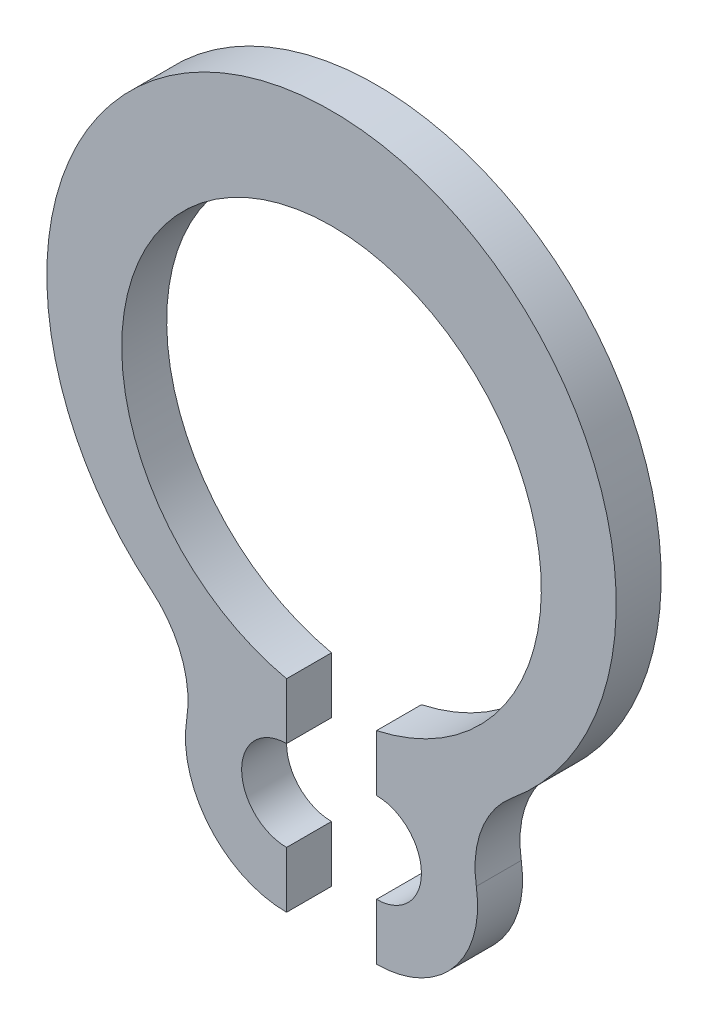
ISO-10303-21;
HEADER;
FILE_DESCRIPTION(('STEP AP214'),'2;1');
FILE_NAME('part.step','',(''),(''),'','','');
FILE_SCHEMA(('AUTOMOTIVE_DESIGN { 1 0 10303 214 1 1 1 1 }'));
ENDSEC;
DATA;
#1=APPLICATION_CONTEXT('core data for automotive mechanical design processes');
#2=APPLICATION_PROTOCOL_DEFINITION('international standard','automotive_design',2000,#1);
#3=PRODUCT_CONTEXT('',#1,'mechanical');
#4=PRODUCT('Part','Part','',(#3));
#5=PRODUCT_RELATED_PRODUCT_CATEGORY('part','',(#4));
#6=PRODUCT_DEFINITION_FORMATION('','',#4);
#7=PRODUCT_DEFINITION_CONTEXT('part definition',#1,'design');
#8=PRODUCT_DEFINITION('design','',#6,#7);
#9=PRODUCT_DEFINITION_SHAPE('','',#8);
#10=(LENGTH_UNIT() NAMED_UNIT(*) SI_UNIT(.MILLI.,.METRE.));
#11=(NAMED_UNIT(*) PLANE_ANGLE_UNIT() SI_UNIT($,.RADIAN.));
#12=(NAMED_UNIT(*) SI_UNIT($,.STERADIAN.) SOLID_ANGLE_UNIT());
#13=UNCERTAINTY_MEASURE_WITH_UNIT(LENGTH_MEASURE(1.E-05),#10,'distance_accuracy_value','');
#14=(GEOMETRIC_REPRESENTATION_CONTEXT(3) GLOBAL_UNCERTAINTY_ASSIGNED_CONTEXT((#13)) GLOBAL_UNIT_ASSIGNED_CONTEXT((#10,
#11,#12)) REPRESENTATION_CONTEXT('',''));
#15=CARTESIAN_POINT('',(0.,0.,0.));
#16=DIRECTION('',(0.,0.,1.));
#17=DIRECTION('',(1.,0.,0.));
#18=AXIS2_PLACEMENT_3D('',#15,#16,#17);
#19=CARTESIAN_POINT('',(-0.6,-4.41495886623547,-0.6));
#20=DIRECTION('',(0.,0.,1.));
#21=DIRECTION('',(1.,0.,0.));
#22=AXIS2_PLACEMENT_3D('',#19,#20,#21);
#23=PLANE('',#22);
#24=DIRECTION('',(0.,1.,0.));
#25=VECTOR('',#24,1.);
#26=CARTESIAN_POINT('',(-0.6,-4.41495886623547,-0.6));
#27=LINE('',#26,#25);
#28=CARTESIAN_POINT('',(-0.599999999999999,-5.76495886623547,-0.6));
#29=VERTEX_POINT('',#28);
#30=CARTESIAN_POINT('',(-0.6,-5.01495886623547,-0.6));
#31=VERTEX_POINT('',#30);
#32=EDGE_CURVE('E113',#29,#31,#27,.T.);
#33=ORIENTED_EDGE('',*,*,#32,.F.);
#34=CARTESIAN_POINT('',(-0.6,-4.41495886623547,-0.6));
#35=DIRECTION('',(0.,0.,1.));
#36=DIRECTION('',(1.,0.,0.));
#37=AXIS2_PLACEMENT_3D('',#34,#35,#36);
#38=CIRCLE('',#37,1.35);
#39=CARTESIAN_POINT('',(-1.93258015045455,-4.19878730794317,-0.6));
#40=VERTEX_POINT('',#39);
#41=EDGE_CURVE('E175',#40,#29,#38,.T.);
#42=ORIENTED_EDGE('',*,*,#41,.F.);
#43=CARTESIAN_POINT('',(-3.26516030090911,-3.98261574965087,-0.6));
#44=DIRECTION('',(0.,0.,1.));
#45=DIRECTION('',(1.,0.,0.));
#46=AXIS2_PLACEMENT_3D('',#43,#44,#45);
#47=CIRCLE('',#46,1.35);
#48=CARTESIAN_POINT('',(-2.40924449387468,-2.93862909682977,-0.6));
#49=VERTEX_POINT('',#48);
#50=EDGE_CURVE('E179',#40,#49,#47,.T.);
#51=ORIENTED_EDGE('',*,*,#50,.T.);
#52=CARTESIAN_POINT('',(0.,0.,-0.6));
#53=DIRECTION('',(0.,0.,1.));
#54=DIRECTION('',(1.,0.,0.));
#55=AXIS2_PLACEMENT_3D('',#52,#53,#54);
#56=CIRCLE('',#55,3.8);
#57=CARTESIAN_POINT('',(2.40924449387468,-2.93862909682977,-0.6));
#58=VERTEX_POINT('',#57);
#59=EDGE_CURVE('E183',#58,#49,#56,.T.);
#60=ORIENTED_EDGE('',*,*,#59,.F.);
#61=CARTESIAN_POINT('',(3.26516030090911,-3.98261574965087,-0.6));
#62=DIRECTION('',(0.,0.,1.));
#63=DIRECTION('',(1.,0.,0.));
#64=AXIS2_PLACEMENT_3D('',#61,#62,#63);
#65=CIRCLE('',#64,1.35);
#66=CARTESIAN_POINT('',(1.93258015045455,-4.19878730794317,-0.6));
#67=VERTEX_POINT('',#66);
#68=EDGE_CURVE('E188',#58,#67,#65,.T.);
#69=ORIENTED_EDGE('',*,*,#68,.T.);
#70=CARTESIAN_POINT('',(0.600000000000001,-4.41495886623547,-0.6));
#71=DIRECTION('',(0.,0.,1.));
#72=DIRECTION('',(1.,0.,0.));
#73=AXIS2_PLACEMENT_3D('',#70,#71,#72);
#74=CIRCLE('',#73,1.35);
#75=CARTESIAN_POINT('',(0.600000000000001,-5.76495886623547,-0.6));
#76=VERTEX_POINT('',#75);
#77=EDGE_CURVE('E192',#76,#67,#74,.T.);
#78=ORIENTED_EDGE('',*,*,#77,.F.);
#79=DIRECTION('',(0.,-1.,0.));
#80=VECTOR('',#79,1.);
#81=CARTESIAN_POINT('',(0.600000000000001,-5.01495886623547,-0.6));
#82=LINE('',#81,#80);
#83=CARTESIAN_POINT('',(0.600000000000001,-5.01495886623547,-0.6));
#84=VERTEX_POINT('',#83);
#85=EDGE_CURVE('E136',#84,#76,#82,.T.);
#86=ORIENTED_EDGE('',*,*,#85,.F.);
#87=CARTESIAN_POINT('',(0.600000000000001,-4.41495886623547,-0.6));
#88=DIRECTION('',(0.,0.,1.));
#89=DIRECTION('',(1.,0.,0.));
#90=AXIS2_PLACEMENT_3D('',#87,#88,#89);
#91=CIRCLE('',#90,0.6);
#92=CARTESIAN_POINT('',(0.600000000000001,-3.81495886623547,-0.6));
#93=VERTEX_POINT('',#92);
#94=EDGE_CURVE('E196',#84,#93,#91,.T.);
#95=ORIENTED_EDGE('',*,*,#94,.T.);
#96=DIRECTION('',(0.,-1.,0.));
#97=VECTOR('',#96,1.);
#98=CARTESIAN_POINT('',(0.6,-3.06495886623547,-0.6));
#99=LINE('',#98,#97);
#100=CARTESIAN_POINT('',(0.6,-3.06495886623547,-0.6));
#101=VERTEX_POINT('',#100);
#102=EDGE_CURVE('E142',#101,#93,#99,.T.);
#103=ORIENTED_EDGE('',*,*,#102,.F.);
#104=CARTESIAN_POINT('',(0.,-0.33,-0.6));
#105=DIRECTION('',(0.,0.,1.));
#106=DIRECTION('',(1.,0.,0.));
#107=AXIS2_PLACEMENT_3D('',#104,#105,#106);
#108=CIRCLE('',#107,2.8);
#109=CARTESIAN_POINT('',(-0.6,-3.06495886623547,-0.6));
#110=VERTEX_POINT('',#109);
#111=EDGE_CURVE('E117',#101,#110,#108,.T.);
#112=ORIENTED_EDGE('',*,*,#111,.T.);
#113=DIRECTION('',(0.,1.,0.));
#114=VECTOR('',#113,1.);
#115=CARTESIAN_POINT('',(-0.6,-3.06495886623547,-0.6));
#116=LINE('',#115,#114);
#117=CARTESIAN_POINT('',(-0.6,-3.81495886623547,-0.6));
#118=VERTEX_POINT('',#117);
#119=EDGE_CURVE('E115',#118,#110,#116,.T.);
#120=ORIENTED_EDGE('',*,*,#119,.F.);
#121=CARTESIAN_POINT('',(-0.6,-4.41495886623547,-0.6));
#122=DIRECTION('',(0.,0.,1.));
#123=DIRECTION('',(1.,0.,0.));
#124=AXIS2_PLACEMENT_3D('',#121,#122,#123);
#125=CIRCLE('',#124,0.6);
#126=EDGE_CURVE('E19',#118,#31,#125,.T.);
#127=ORIENTED_EDGE('',*,*,#126,.T.);
#128=EDGE_LOOP('',(#33,#42,#51,#60,#69,#78,#86,#95,#103,#112,#120,#127));
#129=FACE_BOUND('',#128,.T.);
#130=ADVANCED_FACE('F16',(#129),#23,.F.);
#131=CARTESIAN_POINT('',(-0.6,-4.41495886623547,-0.6));
#132=DIRECTION('',(0.,0.,1.));
#133=DIRECTION('',(1.,0.,0.));
#134=AXIS2_PLACEMENT_3D('',#131,#132,#133);
#135=CYLINDRICAL_SURFACE('',#134,0.6);
#136=DIRECTION('',(0.,0.,1.));
#137=VECTOR('',#136,1.);
#138=CARTESIAN_POINT('',(-0.6,-5.01495886623547,-0.6));
#139=LINE('',#138,#137);
#140=CARTESIAN_POINT('',(-0.6,-5.01495886623547,0.));
#141=VERTEX_POINT('',#140);
#142=EDGE_CURVE('E110',#31,#141,#139,.T.);
#143=ORIENTED_EDGE('',*,*,#142,.F.);
#144=ORIENTED_EDGE('',*,*,#126,.F.);
#145=DIRECTION('',(0.,0.,1.));
#146=VECTOR('',#145,1.);
#147=CARTESIAN_POINT('',(-0.6,-3.81495886623547,-0.6));
#148=LINE('',#147,#146);
#149=CARTESIAN_POINT('',(-0.6,-3.81495886623547,0.));
#150=VERTEX_POINT('',#149);
#151=EDGE_CURVE('E107',#150,#118,#148,.F.);
#152=ORIENTED_EDGE('',*,*,#151,.F.);
#153=CARTESIAN_POINT('',(-0.6,-4.41495886623547,0.));
#154=DIRECTION('',(0.,0.,1.));
#155=DIRECTION('',(1.,0.,0.));
#156=AXIS2_PLACEMENT_3D('',#153,#154,#155);
#157=CIRCLE('',#156,0.6);
#158=EDGE_CURVE('E172',#141,#150,#157,.F.);
#159=ORIENTED_EDGE('',*,*,#158,.F.);
#160=EDGE_LOOP('',(#143,#144,#152,#159));
#161=FACE_BOUND('',#160,.T.);
#162=ADVANCED_FACE('F105',(#161),#135,.F.);
#163=CARTESIAN_POINT('',(-0.6,-3.06495886623547,-0.6));
#164=DIRECTION('',(1.,0.,0.));
#165=DIRECTION('',(0.,1.,0.));
#166=AXIS2_PLACEMENT_3D('',#163,#164,#165);
#167=PLANE('',#166);
#168=ORIENTED_EDGE('',*,*,#119,.T.);
#169=DIRECTION('',(0.,0.,1.));
#170=VECTOR('',#169,1.);
#171=CARTESIAN_POINT('',(-0.600000000000001,-3.06495886623547,-0.6));
#172=LINE('',#171,#170);
#173=CARTESIAN_POINT('',(-0.6,-3.06495886623547,0.));
#174=VERTEX_POINT('',#173);
#175=EDGE_CURVE('E121',#110,#174,#172,.T.);
#176=ORIENTED_EDGE('',*,*,#175,.T.);
#177=DIRECTION('',(0.,1.,0.));
#178=VECTOR('',#177,1.);
#179=CARTESIAN_POINT('',(-0.6,-4.41495886623547,0.));
#180=LINE('',#179,#178);
#181=EDGE_CURVE('E125',#150,#174,#180,.T.);
#182=ORIENTED_EDGE('',*,*,#181,.F.);
#183=ORIENTED_EDGE('',*,*,#151,.T.);
#184=EDGE_LOOP('',(#168,#176,#182,#183));
#185=FACE_BOUND('',#184,.T.);
#186=ADVANCED_FACE('F123',(#185),#167,.T.);
#187=CARTESIAN_POINT('',(0.,-0.33,-0.6));
#188=DIRECTION('',(0.,0.,1.));
#189=DIRECTION('',(1.,0.,0.));
#190=AXIS2_PLACEMENT_3D('',#187,#188,#189);
#191=CYLINDRICAL_SURFACE('',#190,2.8);
#192=ORIENTED_EDGE('',*,*,#111,.F.);
#193=DIRECTION('',(0.,0.,1.));
#194=VECTOR('',#193,1.);
#195=CARTESIAN_POINT('',(0.6,-3.06495886623547,-0.6));
#196=LINE('',#195,#194);
#197=CARTESIAN_POINT('',(0.6,-3.06495886623547,0.));
#198=VERTEX_POINT('',#197);
#199=EDGE_CURVE('E146',#198,#101,#196,.F.);
#200=ORIENTED_EDGE('',*,*,#199,.F.);
#201=CARTESIAN_POINT('',(0.,-0.33,0.));
#202=DIRECTION('',(0.,0.,1.));
#203=DIRECTION('',(1.,0.,0.));
#204=AXIS2_PLACEMENT_3D('',#201,#202,#203);
#205=CIRCLE('',#204,2.8);
#206=EDGE_CURVE('E169',#174,#198,#205,.F.);
#207=ORIENTED_EDGE('',*,*,#206,.F.);
#208=ORIENTED_EDGE('',*,*,#175,.F.);
#209=EDGE_LOOP('',(#192,#200,#207,#208));
#210=FACE_BOUND('',#209,.T.);
#211=ADVANCED_FACE('F205',(#210),#191,.F.);
#212=CARTESIAN_POINT('',(0.6,-3.06495886623547,-0.6));
#213=DIRECTION('',(-1.,0.,0.));
#214=DIRECTION('',(0.,-1.,0.));
#215=AXIS2_PLACEMENT_3D('',#212,#213,#214);
#216=PLANE('',#215);
#217=ORIENTED_EDGE('',*,*,#102,.T.);
#218=DIRECTION('',(0.,0.,1.));
#219=VECTOR('',#218,1.);
#220=CARTESIAN_POINT('',(0.600000000000001,-3.81495886623547,-0.6));
#221=LINE('',#220,#219);
#222=CARTESIAN_POINT('',(0.6,-3.81495886623547,0.));
#223=VERTEX_POINT('',#222);
#224=EDGE_CURVE('E145',#93,#223,#221,.T.);
#225=ORIENTED_EDGE('',*,*,#224,.T.);
#226=DIRECTION('',(0.,1.,0.));
#227=VECTOR('',#226,1.);
#228=CARTESIAN_POINT('',(0.6,-4.41495886623547,0.));
#229=LINE('',#228,#227);
#230=EDGE_CURVE('E168',#198,#223,#229,.F.);
#231=ORIENTED_EDGE('',*,*,#230,.F.);
#232=ORIENTED_EDGE('',*,*,#199,.T.);
#233=EDGE_LOOP('',(#217,#225,#231,#232));
#234=FACE_BOUND('',#233,.T.);
#235=ADVANCED_FACE('F241',(#234),#216,.T.);
#236=CARTESIAN_POINT('',(0.600000000000001,-4.41495886623547,-0.6));
#237=DIRECTION('',(0.,0.,1.));
#238=DIRECTION('',(1.,0.,0.));
#239=AXIS2_PLACEMENT_3D('',#236,#237,#238);
#240=CYLINDRICAL_SURFACE('',#239,0.6);
#241=ORIENTED_EDGE('',*,*,#94,.F.);
#242=DIRECTION('',(0.,0.,1.));
#243=VECTOR('',#242,1.);
#244=CARTESIAN_POINT('',(0.600000000000001,-5.01495886623547,-0.6));
#245=LINE('',#244,#243);
#246=CARTESIAN_POINT('',(0.600000000000001,-5.01495886623547,0.));
#247=VERTEX_POINT('',#246);
#248=EDGE_CURVE('E141',#247,#84,#245,.F.);
#249=ORIENTED_EDGE('',*,*,#248,.F.);
#250=CARTESIAN_POINT('',(0.600000000000001,-4.41495886623547,0.));
#251=DIRECTION('',(0.,0.,1.));
#252=DIRECTION('',(1.,0.,0.));
#253=AXIS2_PLACEMENT_3D('',#250,#251,#252);
#254=CIRCLE('',#253,0.6);
#255=EDGE_CURVE('E165',#223,#247,#254,.F.);
#256=ORIENTED_EDGE('',*,*,#255,.F.);
#257=ORIENTED_EDGE('',*,*,#224,.F.);
#258=EDGE_LOOP('',(#241,#249,#256,#257));
#259=FACE_BOUND('',#258,.T.);
#260=ADVANCED_FACE('F244',(#259),#240,.F.);
#261=CARTESIAN_POINT('',(0.600000000000001,-5.01495886623547,-0.6));
#262=DIRECTION('',(-1.,0.,0.));
#263=DIRECTION('',(0.,-1.,0.));
#264=AXIS2_PLACEMENT_3D('',#261,#262,#263);
#265=PLANE('',#264);
#266=ORIENTED_EDGE('',*,*,#85,.T.);
#267=DIRECTION('',(0.,0.,1.));
#268=VECTOR('',#267,1.);
#269=CARTESIAN_POINT('',(0.600000000000001,-5.76495886623547,-0.6));
#270=LINE('',#269,#268);
#271=CARTESIAN_POINT('',(0.600000000000001,-5.76495886623547,0.));
#272=VERTEX_POINT('',#271);
#273=EDGE_CURVE('E140',#272,#76,#270,.F.);
#274=ORIENTED_EDGE('',*,*,#273,.F.);
#275=DIRECTION('',(0.,1.,0.));
#276=VECTOR('',#275,1.);
#277=CARTESIAN_POINT('',(0.600000000000001,-4.41495886623547,0.));
#278=LINE('',#277,#276);
#279=EDGE_CURVE('E164',#247,#272,#278,.F.);
#280=ORIENTED_EDGE('',*,*,#279,.F.);
#281=ORIENTED_EDGE('',*,*,#248,.T.);
#282=EDGE_LOOP('',(#266,#274,#280,#281));
#283=FACE_BOUND('',#282,.T.);
#284=ADVANCED_FACE('F253',(#283),#265,.T.);
#285=CARTESIAN_POINT('',(0.600000000000001,-4.41495886623547,-0.6));
#286=DIRECTION('',(0.,0.,1.));
#287=DIRECTION('',(1.,0.,0.));
#288=AXIS2_PLACEMENT_3D('',#285,#286,#287);
#289=CYLINDRICAL_SURFACE('',#288,1.35);
#290=DIRECTION('',(0.,0.,1.));
#291=VECTOR('',#290,1.);
#292=CARTESIAN_POINT('',(1.93258015045455,-4.19878730794317,-0.6));
#293=LINE('',#292,#291);
#294=CARTESIAN_POINT('',(1.93258015045455,-4.19878730794317,0.));
#295=VERTEX_POINT('',#294);
#296=EDGE_CURVE('E191',#67,#295,#293,.T.);
#297=ORIENTED_EDGE('',*,*,#296,.T.);
#298=CARTESIAN_POINT('',(0.600000000000001,-4.41495886623547,0.));
#299=DIRECTION('',(0.,0.,1.));
#300=DIRECTION('',(1.,0.,0.));
#301=AXIS2_PLACEMENT_3D('',#298,#299,#300);
#302=CIRCLE('',#301,1.35);
#303=EDGE_CURVE('E161',#272,#295,#302,.T.);
#304=ORIENTED_EDGE('',*,*,#303,.F.);
#305=ORIENTED_EDGE('',*,*,#273,.T.);
#306=ORIENTED_EDGE('',*,*,#77,.T.);
#307=EDGE_LOOP('',(#297,#304,#305,#306));
#308=FACE_BOUND('',#307,.T.);
#309=ADVANCED_FACE('F256',(#308),#289,.T.);
#310=CARTESIAN_POINT('',(3.26516030090911,-3.98261574965087,-0.6));
#311=DIRECTION('',(0.,0.,1.));
#312=DIRECTION('',(1.,0.,0.));
#313=AXIS2_PLACEMENT_3D('',#310,#311,#312);
#314=CYLINDRICAL_SURFACE('',#313,1.35);
#315=ORIENTED_EDGE('',*,*,#296,.F.);
#316=ORIENTED_EDGE('',*,*,#68,.F.);
#317=DIRECTION('',(0.,0.,1.));
#318=VECTOR('',#317,1.);
#319=CARTESIAN_POINT('',(2.40924449387468,-2.93862909682977,-0.6));
#320=LINE('',#319,#318);
#321=CARTESIAN_POINT('',(2.40924449387468,-2.93862909682977,0.));
#322=VERTEX_POINT('',#321);
#323=EDGE_CURVE('E187',#322,#58,#320,.F.);
#324=ORIENTED_EDGE('',*,*,#323,.F.);
#325=CARTESIAN_POINT('',(3.26516030090911,-3.98261574965087,0.));
#326=DIRECTION('',(0.,0.,1.));
#327=DIRECTION('',(1.,0.,0.));
#328=AXIS2_PLACEMENT_3D('',#325,#326,#327);
#329=CIRCLE('',#328,1.35);
#330=EDGE_CURVE('E157',#295,#322,#329,.F.);
#331=ORIENTED_EDGE('',*,*,#330,.F.);
#332=EDGE_LOOP('',(#315,#316,#324,#331));
#333=FACE_BOUND('',#332,.T.);
#334=ADVANCED_FACE('F261',(#333),#314,.F.);
#335=CARTESIAN_POINT('',(0.,0.,-0.6));
#336=DIRECTION('',(0.,0.,1.));
#337=DIRECTION('',(1.,0.,0.));
#338=AXIS2_PLACEMENT_3D('',#335,#336,#337);
#339=CYLINDRICAL_SURFACE('',#338,3.8);
#340=DIRECTION('',(0.,0.,1.));
#341=VECTOR('',#340,1.);
#342=CARTESIAN_POINT('',(-2.40924449387468,-2.93862909682977,-0.6));
#343=LINE('',#342,#341);
#344=CARTESIAN_POINT('',(-2.40924449387468,-2.93862909682977,0.));
#345=VERTEX_POINT('',#344);
#346=EDGE_CURVE('E182',#49,#345,#343,.T.);
#347=ORIENTED_EDGE('',*,*,#346,.T.);
#348=CARTESIAN_POINT('',(0.,0.,0.));
#349=DIRECTION('',(0.,0.,1.));
#350=DIRECTION('',(1.,0.,0.));
#351=AXIS2_PLACEMENT_3D('',#348,#349,#350);
#352=CIRCLE('',#351,3.8);
#353=EDGE_CURVE('E154',#322,#345,#352,.T.);
#354=ORIENTED_EDGE('',*,*,#353,.F.);
#355=ORIENTED_EDGE('',*,*,#323,.T.);
#356=ORIENTED_EDGE('',*,*,#59,.T.);
#357=EDGE_LOOP('',(#347,#354,#355,#356));
#358=FACE_BOUND('',#357,.T.);
#359=ADVANCED_FACE('F267',(#358),#339,.T.);
#360=CARTESIAN_POINT('',(-3.26516030090911,-3.98261574965087,-0.6));
#361=DIRECTION('',(0.,0.,1.));
#362=DIRECTION('',(1.,0.,0.));
#363=AXIS2_PLACEMENT_3D('',#360,#361,#362);
#364=CYLINDRICAL_SURFACE('',#363,1.35);
#365=ORIENTED_EDGE('',*,*,#50,.F.);
#366=DIRECTION('',(0.,0.,1.));
#367=VECTOR('',#366,1.);
#368=CARTESIAN_POINT('',(-1.93258015045455,-4.19878730794317,-0.6));
#369=LINE('',#368,#367);
#370=CARTESIAN_POINT('',(-1.93258015045455,-4.19878730794317,0.));
#371=VERTEX_POINT('',#370);
#372=EDGE_CURVE('E178',#371,#40,#369,.F.);
#373=ORIENTED_EDGE('',*,*,#372,.F.);
#374=CARTESIAN_POINT('',(-3.26516030090911,-3.98261574965087,0.));
#375=DIRECTION('',(0.,0.,1.));
#376=DIRECTION('',(1.,0.,0.));
#377=AXIS2_PLACEMENT_3D('',#374,#375,#376);
#378=CIRCLE('',#377,1.35);
#379=EDGE_CURVE('E151',#345,#371,#378,.F.);
#380=ORIENTED_EDGE('',*,*,#379,.F.);
#381=ORIENTED_EDGE('',*,*,#346,.F.);
#382=EDGE_LOOP('',(#365,#373,#380,#381));
#383=FACE_BOUND('',#382,.T.);
#384=ADVANCED_FACE('F269',(#383),#364,.F.);
#385=CARTESIAN_POINT('',(-0.6,-4.41495886623547,-0.6));
#386=DIRECTION('',(0.,0.,1.));
#387=DIRECTION('',(1.,0.,0.));
#388=AXIS2_PLACEMENT_3D('',#385,#386,#387);
#389=CYLINDRICAL_SURFACE('',#388,1.35);
#390=ORIENTED_EDGE('',*,*,#41,.T.);
#391=DIRECTION('',(0.,0.,1.));
#392=VECTOR('',#391,1.);
#393=CARTESIAN_POINT('',(-0.599999999999999,-5.76495886623547,-0.6));
#394=LINE('',#393,#392);
#395=CARTESIAN_POINT('',(-0.599999999999999,-5.76495886623547,0.));
#396=VERTEX_POINT('',#395);
#397=EDGE_CURVE('E35',#396,#29,#394,.F.);
#398=ORIENTED_EDGE('',*,*,#397,.F.);
#399=CARTESIAN_POINT('',(-0.6,-4.41495886623547,0.));
#400=DIRECTION('',(0.,0.,1.));
#401=DIRECTION('',(1.,0.,0.));
#402=AXIS2_PLACEMENT_3D('',#399,#400,#401);
#403=CIRCLE('',#402,1.35);
#404=EDGE_CURVE('E26',#371,#396,#403,.T.);
#405=ORIENTED_EDGE('',*,*,#404,.F.);
#406=ORIENTED_EDGE('',*,*,#372,.T.);
#407=EDGE_LOOP('',(#390,#398,#405,#406));
#408=FACE_BOUND('',#407,.T.);
#409=ADVANCED_FACE('F271',(#408),#389,.T.);
#410=CARTESIAN_POINT('',(-0.6,-5.01495886623547,-0.6));
#411=DIRECTION('',(1.,0.,0.));
#412=DIRECTION('',(0.,1.,0.));
#413=AXIS2_PLACEMENT_3D('',#410,#411,#412);
#414=PLANE('',#413);
#415=ORIENTED_EDGE('',*,*,#32,.T.);
#416=ORIENTED_EDGE('',*,*,#142,.T.);
#417=DIRECTION('',(0.,1.,0.));
#418=VECTOR('',#417,1.);
#419=CARTESIAN_POINT('',(-0.6,-4.41495886623547,0.));
#420=LINE('',#419,#418);
#421=EDGE_CURVE('E11',#396,#141,#420,.T.);
#422=ORIENTED_EDGE('',*,*,#421,.F.);
#423=ORIENTED_EDGE('',*,*,#397,.T.);
#424=EDGE_LOOP('',(#415,#416,#422,#423));
#425=FACE_BOUND('',#424,.T.);
#426=ADVANCED_FACE('F273',(#425),#414,.T.);
#427=CARTESIAN_POINT('',(-0.6,-4.41495886623547,0.));
#428=DIRECTION('',(0.,0.,1.));
#429=DIRECTION('',(1.,0.,0.));
#430=AXIS2_PLACEMENT_3D('',#427,#428,#429);
#431=PLANE('',#430);
#432=ORIENTED_EDGE('',*,*,#404,.T.);
#433=ORIENTED_EDGE('',*,*,#421,.T.);
#434=ORIENTED_EDGE('',*,*,#158,.T.);
#435=ORIENTED_EDGE('',*,*,#181,.T.);
#436=ORIENTED_EDGE('',*,*,#206,.T.);
#437=ORIENTED_EDGE('',*,*,#230,.T.);
#438=ORIENTED_EDGE('',*,*,#255,.T.);
#439=ORIENTED_EDGE('',*,*,#279,.T.);
#440=ORIENTED_EDGE('',*,*,#303,.T.);
#441=ORIENTED_EDGE('',*,*,#330,.T.);
#442=ORIENTED_EDGE('',*,*,#353,.T.);
#443=ORIENTED_EDGE('',*,*,#379,.T.);
#444=EDGE_LOOP('',(#432,#433,#434,#435,#436,#437,#438,#439,#440,#441,#442,#443));
#445=FACE_BOUND('',#444,.T.);
#446=ADVANCED_FACE('F209',(#445),#431,.T.);
#447=CLOSED_SHELL('',(#130,#162,#186,#211,#235,#260,#284,#309,#334,#359,#384,#409,#426,#446));
#448=MANIFOLD_SOLID_BREP('B1',#447);
#449=ADVANCED_BREP_SHAPE_REPRESENTATION('',(#18,#448),#14);
#450=SHAPE_DEFINITION_REPRESENTATION(#9,#449);
ENDSEC;
END-ISO-10303-21;
